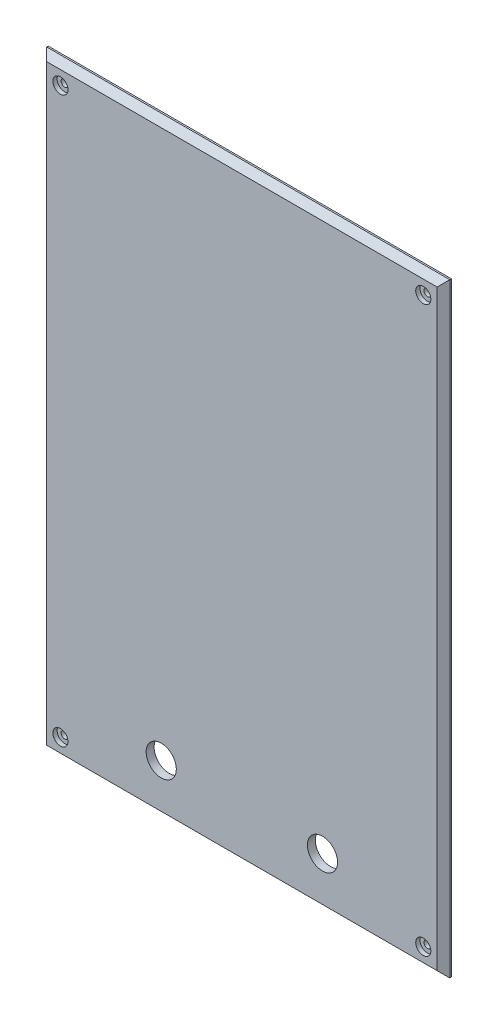
ISO-10303-21;
HEADER;
FILE_DESCRIPTION(('STEP AP214'),'2;1');
FILE_NAME('part.step','',(''),(''),'','','');
FILE_SCHEMA(('AUTOMOTIVE_DESIGN { 1 0 10303 214 1 1 1 1 }'));
ENDSEC;
DATA;
#1=APPLICATION_CONTEXT('core data for automotive mechanical design processes');
#2=APPLICATION_PROTOCOL_DEFINITION('international standard','automotive_design',2000,#1);
#3=PRODUCT_CONTEXT('',#1,'mechanical');
#4=PRODUCT('Part','Part','',(#3));
#5=PRODUCT_RELATED_PRODUCT_CATEGORY('part','',(#4));
#6=PRODUCT_DEFINITION_FORMATION('','',#4);
#7=PRODUCT_DEFINITION_CONTEXT('part definition',#1,'design');
#8=PRODUCT_DEFINITION('design','',#6,#7);
#9=PRODUCT_DEFINITION_SHAPE('','',#8);
#10=(LENGTH_UNIT() NAMED_UNIT(*) SI_UNIT(.MILLI.,.METRE.));
#11=(NAMED_UNIT(*) PLANE_ANGLE_UNIT() SI_UNIT($,.RADIAN.));
#12=(NAMED_UNIT(*) SI_UNIT($,.STERADIAN.) SOLID_ANGLE_UNIT());
#13=UNCERTAINTY_MEASURE_WITH_UNIT(LENGTH_MEASURE(1.E-05),#10,'distance_accuracy_value','');
#14=(GEOMETRIC_REPRESENTATION_CONTEXT(3) GLOBAL_UNCERTAINTY_ASSIGNED_CONTEXT((#13)) GLOBAL_UNIT_ASSIGNED_CONTEXT((#10,
#11,#12)) REPRESENTATION_CONTEXT('',''));
#15=CARTESIAN_POINT('',(0.,0.,0.));
#16=DIRECTION('',(0.,0.,1.));
#17=DIRECTION('',(1.,0.,0.));
#18=AXIS2_PLACEMENT_3D('',#15,#16,#17);
#19=CARTESIAN_POINT('',(-127.,190.5,5.));
#20=DIRECTION('',(1.,0.,0.));
#21=DIRECTION('',(0.,0.,-1.));
#22=AXIS2_PLACEMENT_3D('',#19,#20,#21);
#23=PLANE('',#22);
#24=DIRECTION('',(0.,0.,-1.));
#25=VECTOR('',#24,1.);
#26=CARTESIAN_POINT('',(-127.,-190.5,5.));
#27=LINE('',#26,#25);
#28=CARTESIAN_POINT('',(-127.,-190.5,0.999999999999997));
#29=VERTEX_POINT('',#28);
#30=CARTESIAN_POINT('',(-127.,-190.5,0.));
#31=VERTEX_POINT('',#30);
#32=EDGE_CURVE('E93',#29,#31,#27,.T.);
#33=ORIENTED_EDGE('',*,*,#32,.F.);
#34=DIRECTION('',(0.,1.,0.));
#35=VECTOR('',#34,1.);
#36=CARTESIAN_POINT('',(-127.,190.5,0.999999999999997));
#37=LINE('',#36,#35);
#38=CARTESIAN_POINT('',(-127.,190.5,0.999999999999997));
#39=VERTEX_POINT('',#38);
#40=EDGE_CURVE('E156',#29,#39,#37,.T.);
#41=ORIENTED_EDGE('',*,*,#40,.T.);
#42=DIRECTION('',(0.,0.,-1.));
#43=VECTOR('',#42,1.);
#44=CARTESIAN_POINT('',(-127.,190.5,5.));
#45=LINE('',#44,#43);
#46=CARTESIAN_POINT('',(-127.,190.5,0.));
#47=VERTEX_POINT('',#46);
#48=EDGE_CURVE('E118',#39,#47,#45,.T.);
#49=ORIENTED_EDGE('',*,*,#48,.T.);
#50=DIRECTION('',(0.,-1.,0.));
#51=VECTOR('',#50,1.);
#52=CARTESIAN_POINT('',(-127.,190.5,0.));
#53=LINE('',#52,#51);
#54=EDGE_CURVE('E113',#47,#31,#53,.T.);
#55=ORIENTED_EDGE('',*,*,#54,.T.);
#56=EDGE_LOOP('',(#33,#41,#49,#55));
#57=FACE_BOUND('',#56,.T.);
#58=ADVANCED_FACE('F38',(#57),#23,.F.);
#59=CARTESIAN_POINT('',(-127.,-190.5,5.));
#60=DIRECTION('',(0.,1.,0.));
#61=DIRECTION('',(0.,0.,1.));
#62=AXIS2_PLACEMENT_3D('',#59,#60,#61);
#63=PLANE('',#62);
#64=DIRECTION('',(0.,0.,-1.));
#65=VECTOR('',#64,1.);
#66=CARTESIAN_POINT('',(127.,-190.5,5.));
#67=LINE('',#66,#65);
#68=CARTESIAN_POINT('',(127.,-190.5,0.999999999999997));
#69=VERTEX_POINT('',#68);
#70=CARTESIAN_POINT('',(127.,-190.5,0.));
#71=VERTEX_POINT('',#70);
#72=EDGE_CURVE('E106',#69,#71,#67,.T.);
#73=ORIENTED_EDGE('',*,*,#72,.F.);
#74=DIRECTION('',(-1.,0.,0.));
#75=VECTOR('',#74,1.);
#76=CARTESIAN_POINT('',(-127.,-190.5,0.999999999999997));
#77=LINE('',#76,#75);
#78=EDGE_CURVE('E99',#69,#29,#77,.T.);
#79=ORIENTED_EDGE('',*,*,#78,.T.);
#80=ORIENTED_EDGE('',*,*,#32,.T.);
#81=DIRECTION('',(1.,0.,0.));
#82=VECTOR('',#81,1.);
#83=CARTESIAN_POINT('',(-127.,-190.5,0.));
#84=LINE('',#83,#82);
#85=EDGE_CURVE('E96',#31,#71,#84,.T.);
#86=ORIENTED_EDGE('',*,*,#85,.T.);
#87=EDGE_LOOP('',(#73,#79,#80,#86));
#88=FACE_BOUND('',#87,.T.);
#89=ADVANCED_FACE('F95',(#88),#63,.F.);
#90=CARTESIAN_POINT('',(127.,190.5,5.));
#91=DIRECTION('',(-1.,0.,0.));
#92=DIRECTION('',(0.,0.,1.));
#93=AXIS2_PLACEMENT_3D('',#90,#91,#92);
#94=PLANE('',#93);
#95=DIRECTION('',(0.,0.,-1.));
#96=VECTOR('',#95,1.);
#97=CARTESIAN_POINT('',(127.,190.5,5.));
#98=LINE('',#97,#96);
#99=CARTESIAN_POINT('',(127.,190.5,0.999999999999997));
#100=VERTEX_POINT('',#99);
#101=CARTESIAN_POINT('',(127.,190.5,0.));
#102=VERTEX_POINT('',#101);
#103=EDGE_CURVE('E139',#100,#102,#98,.T.);
#104=ORIENTED_EDGE('',*,*,#103,.F.);
#105=DIRECTION('',(0.,-1.,0.));
#106=VECTOR('',#105,1.);
#107=CARTESIAN_POINT('',(127.,-190.5,0.999999999999997));
#108=LINE('',#107,#106);
#109=EDGE_CURVE('E61',#100,#69,#108,.T.);
#110=ORIENTED_EDGE('',*,*,#109,.T.);
#111=ORIENTED_EDGE('',*,*,#72,.T.);
#112=DIRECTION('',(0.,1.,0.));
#113=VECTOR('',#112,1.);
#114=CARTESIAN_POINT('',(127.,190.5,0.));
#115=LINE('',#114,#113);
#116=EDGE_CURVE('E115',#71,#102,#115,.T.);
#117=ORIENTED_EDGE('',*,*,#116,.T.);
#118=EDGE_LOOP('',(#104,#110,#111,#117));
#119=FACE_BOUND('',#118,.T.);
#120=ADVANCED_FACE('F225',(#119),#94,.F.);
#121=CARTESIAN_POINT('',(-127.,190.5,5.));
#122=DIRECTION('',(0.,-1.,0.));
#123=DIRECTION('',(0.,0.,-1.));
#124=AXIS2_PLACEMENT_3D('',#121,#122,#123);
#125=PLANE('',#124);
#126=ORIENTED_EDGE('',*,*,#48,.F.);
#127=DIRECTION('',(1.,0.,0.));
#128=VECTOR('',#127,1.);
#129=CARTESIAN_POINT('',(127.,190.5,0.999999999999997));
#130=LINE('',#129,#128);
#131=EDGE_CURVE('E54',#39,#100,#130,.T.);
#132=ORIENTED_EDGE('',*,*,#131,.T.);
#133=ORIENTED_EDGE('',*,*,#103,.T.);
#134=DIRECTION('',(-1.,0.,0.));
#135=VECTOR('',#134,1.);
#136=CARTESIAN_POINT('',(-127.,190.5,0.));
#137=LINE('',#136,#135);
#138=EDGE_CURVE('E134',#102,#47,#137,.T.);
#139=ORIENTED_EDGE('',*,*,#138,.T.);
#140=EDGE_LOOP('',(#126,#132,#133,#139));
#141=FACE_BOUND('',#140,.T.);
#142=ADVANCED_FACE('F215',(#141),#125,.F.);
#143=CARTESIAN_POINT('',(0.,0.,5.));
#144=DIRECTION('',(0.,0.,1.));
#145=DIRECTION('',(1.,0.,0.));
#146=AXIS2_PLACEMENT_3D('',#143,#144,#145);
#147=PLANE('',#146);
#148=CARTESIAN_POINT('',(-50.8,-158.75,5.));
#149=DIRECTION('',(0.,0.,1.));
#150=DIRECTION('',(1.,0.,0.));
#151=AXIS2_PLACEMENT_3D('',#148,#149,#150);
#152=CIRCLE('',#151,9.49999999999999);
#153=CARTESIAN_POINT('',(-41.3,-158.75,5.));
#154=VERTEX_POINT('',#153);
#155=EDGE_CURVE('E351',#154,#154,#152,.T.);
#156=ORIENTED_EDGE('',*,*,#155,.F.);
#157=EDGE_LOOP('',(#156));
#158=FACE_BOUND('',#157,.T.);
#159=CARTESIAN_POINT('',(50.8,-158.75,5.));
#160=DIRECTION('',(0.,0.,1.));
#161=DIRECTION('',(1.,0.,0.));
#162=AXIS2_PLACEMENT_3D('',#159,#160,#161);
#163=CIRCLE('',#162,9.49999999999999);
#164=CARTESIAN_POINT('',(60.3,-158.75,5.));
#165=VERTEX_POINT('',#164);
#166=EDGE_CURVE('E343',#165,#165,#163,.T.);
#167=ORIENTED_EDGE('',*,*,#166,.F.);
#168=EDGE_LOOP('',(#167));
#169=FACE_BOUND('',#168,.T.);
#170=CARTESIAN_POINT('',(-114.3,-177.8,5.));
#171=DIRECTION('',(0.,0.,1.));
#172=DIRECTION('',(1.,0.,0.));
#173=AXIS2_PLACEMENT_3D('',#170,#171,#172);
#174=CIRCLE('',#173,4.7625);
#175=CARTESIAN_POINT('',(-109.5375,-177.8,5.));
#176=VERTEX_POINT('',#175);
#177=EDGE_CURVE('E335',#176,#176,#174,.T.);
#178=ORIENTED_EDGE('',*,*,#177,.F.);
#179=EDGE_LOOP('',(#178));
#180=FACE_BOUND('',#179,.T.);
#181=CARTESIAN_POINT('',(-114.3,177.8,5.));
#182=DIRECTION('',(0.,0.,1.));
#183=DIRECTION('',(1.,0.,0.));
#184=AXIS2_PLACEMENT_3D('',#181,#182,#183);
#185=CIRCLE('',#184,4.7625);
#186=CARTESIAN_POINT('',(-109.5375,177.8,5.));
#187=VERTEX_POINT('',#186);
#188=EDGE_CURVE('E317',#187,#187,#185,.T.);
#189=ORIENTED_EDGE('',*,*,#188,.F.);
#190=EDGE_LOOP('',(#189));
#191=FACE_BOUND('',#190,.T.);
#192=DIRECTION('',(-1.,0.,0.));
#193=VECTOR('',#192,1.);
#194=CARTESIAN_POINT('',(-127.,186.5,5.));
#195=LINE('',#194,#193);
#196=CARTESIAN_POINT('',(123.,186.5,5.));
#197=VERTEX_POINT('',#196);
#198=CARTESIAN_POINT('',(-123.,186.5,5.));
#199=VERTEX_POINT('',#198);
#200=EDGE_CURVE('E105',#197,#199,#195,.T.);
#201=ORIENTED_EDGE('',*,*,#200,.T.);
#202=DIRECTION('',(0.,-1.,0.));
#203=VECTOR('',#202,1.);
#204=CARTESIAN_POINT('',(-123.,-190.5,5.));
#205=LINE('',#204,#203);
#206=CARTESIAN_POINT('',(-123.,-186.5,5.));
#207=VERTEX_POINT('',#206);
#208=EDGE_CURVE('E152',#199,#207,#205,.T.);
#209=ORIENTED_EDGE('',*,*,#208,.T.);
#210=DIRECTION('',(1.,0.,0.));
#211=VECTOR('',#210,1.);
#212=CARTESIAN_POINT('',(127.,-186.5,5.));
#213=LINE('',#212,#211);
#214=CARTESIAN_POINT('',(123.,-186.5,5.));
#215=VERTEX_POINT('',#214);
#216=EDGE_CURVE('E149',#207,#215,#213,.T.);
#217=ORIENTED_EDGE('',*,*,#216,.T.);
#218=DIRECTION('',(0.,1.,0.));
#219=VECTOR('',#218,1.);
#220=CARTESIAN_POINT('',(123.,190.5,5.));
#221=LINE('',#220,#219);
#222=EDGE_CURVE('E146',#215,#197,#221,.T.);
#223=ORIENTED_EDGE('',*,*,#222,.T.);
#224=EDGE_LOOP('',(#201,#209,#217,#223));
#225=FACE_BOUND('',#224,.T.);
#226=CARTESIAN_POINT('',(114.3,177.8,5.));
#227=DIRECTION('',(0.,0.,1.));
#228=DIRECTION('',(1.,0.,0.));
#229=AXIS2_PLACEMENT_3D('',#226,#227,#228);
#230=CIRCLE('',#229,4.7625);
#231=CARTESIAN_POINT('',(119.0625,177.8,5.));
#232=VERTEX_POINT('',#231);
#233=EDGE_CURVE('E165',#232,#232,#230,.T.);
#234=ORIENTED_EDGE('',*,*,#233,.F.);
#235=EDGE_LOOP('',(#234));
#236=FACE_BOUND('',#235,.T.);
#237=CARTESIAN_POINT('',(114.3,-177.8,5.));
#238=DIRECTION('',(0.,0.,1.));
#239=DIRECTION('',(1.,0.,0.));
#240=AXIS2_PLACEMENT_3D('',#237,#238,#239);
#241=CIRCLE('',#240,4.7625);
#242=CARTESIAN_POINT('',(119.0625,-177.8,5.));
#243=VERTEX_POINT('',#242);
#244=EDGE_CURVE('E190',#243,#243,#241,.T.);
#245=ORIENTED_EDGE('',*,*,#244,.F.);
#246=EDGE_LOOP('',(#245));
#247=FACE_BOUND('',#246,.T.);
#248=ADVANCED_FACE('F213',(#158,#169,#180,#191,#225,#236,#247),#147,.T.);
#249=CARTESIAN_POINT('',(0.,0.,0.));
#250=DIRECTION('',(0.,0.,1.));
#251=DIRECTION('',(1.,0.,0.));
#252=AXIS2_PLACEMENT_3D('',#249,#250,#251);
#253=PLANE('',#252);
#254=CARTESIAN_POINT('',(-50.8,-158.75,0.));
#255=DIRECTION('',(0.,0.,1.));
#256=DIRECTION('',(1.,0.,0.));
#257=AXIS2_PLACEMENT_3D('',#254,#255,#256);
#258=CIRCLE('',#257,9.5);
#259=CARTESIAN_POINT('',(-41.3,-158.75,0.));
#260=VERTEX_POINT('',#259);
#261=EDGE_CURVE('E347',#260,#260,#258,.T.);
#262=ORIENTED_EDGE('',*,*,#261,.T.);
#263=EDGE_LOOP('',(#262));
#264=FACE_BOUND('',#263,.T.);
#265=CARTESIAN_POINT('',(50.8,-158.75,0.));
#266=DIRECTION('',(0.,0.,1.));
#267=DIRECTION('',(1.,0.,0.));
#268=AXIS2_PLACEMENT_3D('',#265,#266,#267);
#269=CIRCLE('',#268,9.5);
#270=CARTESIAN_POINT('',(60.3,-158.75,0.));
#271=VERTEX_POINT('',#270);
#272=EDGE_CURVE('E339',#271,#271,#269,.T.);
#273=ORIENTED_EDGE('',*,*,#272,.T.);
#274=EDGE_LOOP('',(#273));
#275=FACE_BOUND('',#274,.T.);
#276=CARTESIAN_POINT('',(-114.3,-177.8,0.));
#277=DIRECTION('',(0.,0.,1.));
#278=DIRECTION('',(1.,0.,0.));
#279=AXIS2_PLACEMENT_3D('',#276,#277,#278);
#280=CIRCLE('',#279,2.2479);
#281=CARTESIAN_POINT('',(-112.0521,-177.8,0.));
#282=VERTEX_POINT('',#281);
#283=EDGE_CURVE('E331',#282,#282,#280,.T.);
#284=ORIENTED_EDGE('',*,*,#283,.T.);
#285=EDGE_LOOP('',(#284));
#286=FACE_BOUND('',#285,.T.);
#287=CARTESIAN_POINT('',(-114.3,177.8,0.));
#288=DIRECTION('',(0.,0.,1.));
#289=DIRECTION('',(1.,0.,0.));
#290=AXIS2_PLACEMENT_3D('',#287,#288,#289);
#291=CIRCLE('',#290,2.2479);
#292=CARTESIAN_POINT('',(-112.0521,177.8,0.));
#293=VERTEX_POINT('',#292);
#294=EDGE_CURVE('E129',#293,#293,#291,.T.);
#295=ORIENTED_EDGE('',*,*,#294,.T.);
#296=EDGE_LOOP('',(#295));
#297=FACE_BOUND('',#296,.T.);
#298=ORIENTED_EDGE('',*,*,#54,.F.);
#299=ORIENTED_EDGE('',*,*,#138,.F.);
#300=ORIENTED_EDGE('',*,*,#116,.F.);
#301=ORIENTED_EDGE('',*,*,#85,.F.);
#302=EDGE_LOOP('',(#298,#299,#300,#301));
#303=FACE_BOUND('',#302,.T.);
#304=CARTESIAN_POINT('',(114.3,177.8,0.));
#305=DIRECTION('',(0.,0.,1.));
#306=DIRECTION('',(1.,0.,0.));
#307=AXIS2_PLACEMENT_3D('',#304,#305,#306);
#308=CIRCLE('',#307,2.2479);
#309=CARTESIAN_POINT('',(116.5479,177.8,0.));
#310=VERTEX_POINT('',#309);
#311=EDGE_CURVE('E178',#310,#310,#308,.T.);
#312=ORIENTED_EDGE('',*,*,#311,.T.);
#313=EDGE_LOOP('',(#312));
#314=FACE_BOUND('',#313,.T.);
#315=CARTESIAN_POINT('',(114.3,-177.8,0.));
#316=DIRECTION('',(0.,0.,1.));
#317=DIRECTION('',(1.,0.,0.));
#318=AXIS2_PLACEMENT_3D('',#315,#316,#317);
#319=CIRCLE('',#318,2.2479);
#320=CARTESIAN_POINT('',(116.5479,-177.8,0.));
#321=VERTEX_POINT('',#320);
#322=EDGE_CURVE('E194',#321,#321,#319,.T.);
#323=ORIENTED_EDGE('',*,*,#322,.T.);
#324=EDGE_LOOP('',(#323));
#325=FACE_BOUND('',#324,.T.);
#326=ADVANCED_FACE('F110',(#264,#275,#286,#297,#303,#314,#325),#253,.F.);
#327=CARTESIAN_POINT('',(123.,0.,5.));
#328=DIRECTION('',(0.707106781186547,0.,0.707106781186547));
#329=DIRECTION('',(0.,-1.,0.));
#330=AXIS2_PLACEMENT_3D('',#327,#328,#329);
#331=PLANE('',#330);
#332=DIRECTION('',(0.577350269189626,-0.577350269189626,-0.577350269189626));
#333=VECTOR('',#332,1.);
#334=CARTESIAN_POINT('',(60.8333333333333,-124.333333333333,67.1666666666667));
#335=LINE('',#334,#333);
#336=EDGE_CURVE('E126',#69,#215,#335,.F.);
#337=ORIENTED_EDGE('',*,*,#336,.F.);
#338=ORIENTED_EDGE('',*,*,#109,.F.);
#339=DIRECTION('',(0.577350269189626,0.577350269189626,-0.577350269189626));
#340=VECTOR('',#339,1.);
#341=CARTESIAN_POINT('',(82.,145.5,46.));
#342=LINE('',#341,#340);
#343=EDGE_CURVE('E121',#197,#100,#342,.T.);
#344=ORIENTED_EDGE('',*,*,#343,.F.);
#345=ORIENTED_EDGE('',*,*,#222,.F.);
#346=EDGE_LOOP('',(#337,#338,#344,#345));
#347=FACE_BOUND('',#346,.T.);
#348=ADVANCED_FACE('F222',(#347),#331,.T.);
#349=CARTESIAN_POINT('',(0.,186.5,5.));
#350=DIRECTION('',(0.,0.707106781186547,0.707106781186547));
#351=DIRECTION('',(1.,0.,0.));
#352=AXIS2_PLACEMENT_3D('',#349,#350,#351);
#353=PLANE('',#352);
#354=ORIENTED_EDGE('',*,*,#343,.T.);
#355=ORIENTED_EDGE('',*,*,#131,.F.);
#356=DIRECTION('',(0.577350269189626,-0.577350269189626,0.577350269189626));
#357=VECTOR('',#356,1.);
#358=CARTESIAN_POINT('',(-82.,145.5,46.));
#359=LINE('',#358,#357);
#360=EDGE_CURVE('E169',#199,#39,#359,.F.);
#361=ORIENTED_EDGE('',*,*,#360,.F.);
#362=ORIENTED_EDGE('',*,*,#200,.F.);
#363=EDGE_LOOP('',(#354,#355,#361,#362));
#364=FACE_BOUND('',#363,.T.);
#365=ADVANCED_FACE('F246',(#364),#353,.T.);
#366=CARTESIAN_POINT('',(0.,-186.5,5.));
#367=DIRECTION('',(0.,-0.707106781186547,0.707106781186547));
#368=DIRECTION('',(-1.,0.,0.));
#369=AXIS2_PLACEMENT_3D('',#366,#367,#368);
#370=PLANE('',#369);
#371=ORIENTED_EDGE('',*,*,#336,.T.);
#372=ORIENTED_EDGE('',*,*,#216,.F.);
#373=DIRECTION('',(-0.577350269189626,-0.577350269189626,-0.577350269189626));
#374=VECTOR('',#373,1.);
#375=CARTESIAN_POINT('',(-82.,-145.5,46.));
#376=LINE('',#375,#374);
#377=EDGE_CURVE('E166',#29,#207,#376,.F.);
#378=ORIENTED_EDGE('',*,*,#377,.F.);
#379=ORIENTED_EDGE('',*,*,#78,.F.);
#380=EDGE_LOOP('',(#371,#372,#378,#379));
#381=FACE_BOUND('',#380,.T.);
#382=ADVANCED_FACE('F242',(#381),#370,.T.);
#383=CARTESIAN_POINT('',(-123.,0.,5.));
#384=DIRECTION('',(-0.707106781186547,0.,0.707106781186547));
#385=DIRECTION('',(0.,1.,0.));
#386=AXIS2_PLACEMENT_3D('',#383,#384,#385);
#387=PLANE('',#386);
#388=ORIENTED_EDGE('',*,*,#360,.T.);
#389=ORIENTED_EDGE('',*,*,#40,.F.);
#390=ORIENTED_EDGE('',*,*,#377,.T.);
#391=ORIENTED_EDGE('',*,*,#208,.F.);
#392=EDGE_LOOP('',(#388,#389,#390,#391));
#393=FACE_BOUND('',#392,.T.);
#394=ADVANCED_FACE('F238',(#393),#387,.T.);
#395=CARTESIAN_POINT('',(-114.3,177.8,5.));
#396=DIRECTION('',(0.,0.,1.));
#397=DIRECTION('',(1.,0.,0.));
#398=AXIS2_PLACEMENT_3D('',#395,#396,#397);
#399=CYLINDRICAL_SURFACE('',#398,2.2479);
#400=ORIENTED_EDGE('',*,*,#294,.F.);
#401=EDGE_LOOP('',(#400));
#402=FACE_BOUND('',#401,.T.);
#403=CARTESIAN_POINT('',(-114.3,177.8,2.333));
#404=DIRECTION('',(0.,0.,1.));
#405=DIRECTION('',(1.,0.,0.));
#406=AXIS2_PLACEMENT_3D('',#403,#404,#405);
#407=CIRCLE('',#406,2.2479);
#408=CARTESIAN_POINT('',(-112.0521,177.8,2.333));
#409=VERTEX_POINT('',#408);
#410=EDGE_CURVE('E312',#409,#409,#407,.T.);
#411=ORIENTED_EDGE('',*,*,#410,.T.);
#412=EDGE_LOOP('',(#411));
#413=FACE_BOUND('',#412,.T.);
#414=ADVANCED_FACE('F241',(#402,#413),#399,.F.);
#415=CARTESIAN_POINT('',(-112.0521,177.8,2.333));
#416=DIRECTION('',(0.,0.,-1.));
#417=DIRECTION('',(-1.,0.,0.));
#418=AXIS2_PLACEMENT_3D('',#415,#416,#417);
#419=PLANE('',#418);
#420=ORIENTED_EDGE('',*,*,#410,.F.);
#421=EDGE_LOOP('',(#420));
#422=FACE_BOUND('',#421,.T.);
#423=CARTESIAN_POINT('',(-114.3,177.8,2.333));
#424=DIRECTION('',(0.,0.,1.));
#425=DIRECTION('',(1.,0.,0.));
#426=AXIS2_PLACEMENT_3D('',#423,#424,#425);
#427=CIRCLE('',#426,4.7625);
#428=CARTESIAN_POINT('',(-109.5375,177.8,2.333));
#429=VERTEX_POINT('',#428);
#430=EDGE_CURVE('E314',#429,#429,#427,.T.);
#431=ORIENTED_EDGE('',*,*,#430,.T.);
#432=EDGE_LOOP('',(#431));
#433=FACE_BOUND('',#432,.T.);
#434=ADVANCED_FACE('F299',(#422,#433),#419,.F.);
#435=CARTESIAN_POINT('',(-114.3,177.8,5.));
#436=DIRECTION('',(0.,0.,1.));
#437=DIRECTION('',(1.,0.,0.));
#438=AXIS2_PLACEMENT_3D('',#435,#436,#437);
#439=CYLINDRICAL_SURFACE('',#438,4.7625);
#440=ORIENTED_EDGE('',*,*,#430,.F.);
#441=EDGE_LOOP('',(#440));
#442=FACE_BOUND('',#441,.T.);
#443=ORIENTED_EDGE('',*,*,#188,.T.);
#444=EDGE_LOOP('',(#443));
#445=FACE_BOUND('',#444,.T.);
#446=ADVANCED_FACE('F295',(#442,#445),#439,.F.);
#447=CARTESIAN_POINT('',(-114.3,-177.8,5.));
#448=DIRECTION('',(0.,0.,1.));
#449=DIRECTION('',(1.,0.,0.));
#450=AXIS2_PLACEMENT_3D('',#447,#448,#449);
#451=CYLINDRICAL_SURFACE('',#450,2.2479);
#452=ORIENTED_EDGE('',*,*,#283,.F.);
#453=EDGE_LOOP('',(#452));
#454=FACE_BOUND('',#453,.T.);
#455=CARTESIAN_POINT('',(-114.3,-177.8,2.333));
#456=DIRECTION('',(0.,0.,1.));
#457=DIRECTION('',(1.,0.,0.));
#458=AXIS2_PLACEMENT_3D('',#455,#456,#457);
#459=CIRCLE('',#458,2.2479);
#460=CARTESIAN_POINT('',(-112.0521,-177.8,2.333));
#461=VERTEX_POINT('',#460);
#462=EDGE_CURVE('E323',#461,#461,#459,.T.);
#463=ORIENTED_EDGE('',*,*,#462,.T.);
#464=EDGE_LOOP('',(#463));
#465=FACE_BOUND('',#464,.T.);
#466=ADVANCED_FACE('F291',(#454,#465),#451,.F.);
#467=CARTESIAN_POINT('',(-112.0521,-177.8,2.333));
#468=DIRECTION('',(0.,0.,-1.));
#469=DIRECTION('',(-1.,0.,0.));
#470=AXIS2_PLACEMENT_3D('',#467,#468,#469);
#471=PLANE('',#470);
#472=ORIENTED_EDGE('',*,*,#462,.F.);
#473=EDGE_LOOP('',(#472));
#474=FACE_BOUND('',#473,.T.);
#475=CARTESIAN_POINT('',(-114.3,-177.8,2.333));
#476=DIRECTION('',(0.,0.,1.));
#477=DIRECTION('',(1.,0.,0.));
#478=AXIS2_PLACEMENT_3D('',#475,#476,#477);
#479=CIRCLE('',#478,4.7625);
#480=CARTESIAN_POINT('',(-109.5375,-177.8,2.333));
#481=VERTEX_POINT('',#480);
#482=EDGE_CURVE('E327',#481,#481,#479,.T.);
#483=ORIENTED_EDGE('',*,*,#482,.T.);
#484=EDGE_LOOP('',(#483));
#485=FACE_BOUND('',#484,.T.);
#486=ADVANCED_FACE('F287',(#474,#485),#471,.F.);
#487=CARTESIAN_POINT('',(-114.3,-177.8,5.));
#488=DIRECTION('',(0.,0.,1.));
#489=DIRECTION('',(1.,0.,0.));
#490=AXIS2_PLACEMENT_3D('',#487,#488,#489);
#491=CYLINDRICAL_SURFACE('',#490,4.7625);
#492=ORIENTED_EDGE('',*,*,#482,.F.);
#493=EDGE_LOOP('',(#492));
#494=FACE_BOUND('',#493,.T.);
#495=ORIENTED_EDGE('',*,*,#177,.T.);
#496=EDGE_LOOP('',(#495));
#497=FACE_BOUND('',#496,.T.);
#498=ADVANCED_FACE('F264',(#494,#497),#491,.F.);
#499=CARTESIAN_POINT('',(114.3,177.8,5.));
#500=DIRECTION('',(0.,0.,1.));
#501=DIRECTION('',(1.,0.,0.));
#502=AXIS2_PLACEMENT_3D('',#499,#500,#501);
#503=CYLINDRICAL_SURFACE('',#502,4.7625);
#504=CARTESIAN_POINT('',(114.3,177.8,2.333));
#505=DIRECTION('',(0.,0.,1.));
#506=DIRECTION('',(1.,0.,0.));
#507=AXIS2_PLACEMENT_3D('',#504,#505,#506);
#508=CIRCLE('',#507,4.7625);
#509=CARTESIAN_POINT('',(119.0625,177.8,2.333));
#510=VERTEX_POINT('',#509);
#511=EDGE_CURVE('E186',#510,#510,#508,.T.);
#512=ORIENTED_EDGE('',*,*,#511,.F.);
#513=EDGE_LOOP('',(#512));
#514=FACE_BOUND('',#513,.T.);
#515=ORIENTED_EDGE('',*,*,#233,.T.);
#516=EDGE_LOOP('',(#515));
#517=FACE_BOUND('',#516,.T.);
#518=ADVANCED_FACE('F260',(#514,#517),#503,.F.);
#519=CARTESIAN_POINT('',(116.5479,177.8,2.333));
#520=DIRECTION('',(0.,0.,-1.));
#521=DIRECTION('',(-1.,0.,0.));
#522=AXIS2_PLACEMENT_3D('',#519,#520,#521);
#523=PLANE('',#522);
#524=CARTESIAN_POINT('',(114.3,177.8,2.333));
#525=DIRECTION('',(0.,0.,1.));
#526=DIRECTION('',(1.,0.,0.));
#527=AXIS2_PLACEMENT_3D('',#524,#525,#526);
#528=CIRCLE('',#527,2.2479);
#529=CARTESIAN_POINT('',(116.5479,177.8,2.333));
#530=VERTEX_POINT('',#529);
#531=EDGE_CURVE('E182',#530,#530,#528,.T.);
#532=ORIENTED_EDGE('',*,*,#531,.F.);
#533=EDGE_LOOP('',(#532));
#534=FACE_BOUND('',#533,.T.);
#535=ORIENTED_EDGE('',*,*,#511,.T.);
#536=EDGE_LOOP('',(#535));
#537=FACE_BOUND('',#536,.T.);
#538=ADVANCED_FACE('F256',(#534,#537),#523,.F.);
#539=CARTESIAN_POINT('',(114.3,177.8,5.));
#540=DIRECTION('',(0.,0.,1.));
#541=DIRECTION('',(1.,0.,0.));
#542=AXIS2_PLACEMENT_3D('',#539,#540,#541);
#543=CYLINDRICAL_SURFACE('',#542,2.2479);
#544=ORIENTED_EDGE('',*,*,#311,.F.);
#545=EDGE_LOOP('',(#544));
#546=FACE_BOUND('',#545,.T.);
#547=ORIENTED_EDGE('',*,*,#531,.T.);
#548=EDGE_LOOP('',(#547));
#549=FACE_BOUND('',#548,.T.);
#550=ADVANCED_FACE('F210',(#546,#549),#543,.F.);
#551=CARTESIAN_POINT('',(114.3,-177.8,5.));
#552=DIRECTION('',(0.,0.,1.));
#553=DIRECTION('',(1.,0.,0.));
#554=AXIS2_PLACEMENT_3D('',#551,#552,#553);
#555=CYLINDRICAL_SURFACE('',#554,4.7625);
#556=CARTESIAN_POINT('',(114.3,-177.8,2.333));
#557=DIRECTION('',(0.,0.,1.));
#558=DIRECTION('',(1.,0.,0.));
#559=AXIS2_PLACEMENT_3D('',#556,#557,#558);
#560=CIRCLE('',#559,4.7625);
#561=CARTESIAN_POINT('',(119.0625,-177.8,2.333));
#562=VERTEX_POINT('',#561);
#563=EDGE_CURVE('E11',#562,#562,#560,.T.);
#564=ORIENTED_EDGE('',*,*,#563,.F.);
#565=EDGE_LOOP('',(#564));
#566=FACE_BOUND('',#565,.T.);
#567=ORIENTED_EDGE('',*,*,#244,.T.);
#568=EDGE_LOOP('',(#567));
#569=FACE_BOUND('',#568,.T.);
#570=ADVANCED_FACE('F40',(#566,#569),#555,.F.);
#571=CARTESIAN_POINT('',(116.5479,-177.8,2.333));
#572=DIRECTION('',(0.,0.,-1.));
#573=DIRECTION('',(-1.,0.,0.));
#574=AXIS2_PLACEMENT_3D('',#571,#572,#573);
#575=PLANE('',#574);
#576=CARTESIAN_POINT('',(114.3,-177.8,2.333));
#577=DIRECTION('',(0.,0.,1.));
#578=DIRECTION('',(1.,0.,0.));
#579=AXIS2_PLACEMENT_3D('',#576,#577,#578);
#580=CIRCLE('',#579,2.2479);
#581=CARTESIAN_POINT('',(116.5479,-177.8,2.333));
#582=VERTEX_POINT('',#581);
#583=EDGE_CURVE('E47',#582,#582,#580,.T.);
#584=ORIENTED_EDGE('',*,*,#583,.F.);
#585=EDGE_LOOP('',(#584));
#586=FACE_BOUND('',#585,.T.);
#587=ORIENTED_EDGE('',*,*,#563,.T.);
#588=EDGE_LOOP('',(#587));
#589=FACE_BOUND('',#588,.T.);
#590=ADVANCED_FACE('F203',(#586,#589),#575,.F.);
#591=CARTESIAN_POINT('',(114.3,-177.8,5.));
#592=DIRECTION('',(0.,0.,1.));
#593=DIRECTION('',(1.,0.,0.));
#594=AXIS2_PLACEMENT_3D('',#591,#592,#593);
#595=CYLINDRICAL_SURFACE('',#594,2.2479);
#596=ORIENTED_EDGE('',*,*,#322,.F.);
#597=EDGE_LOOP('',(#596));
#598=FACE_BOUND('',#597,.T.);
#599=ORIENTED_EDGE('',*,*,#583,.T.);
#600=EDGE_LOOP('',(#599));
#601=FACE_BOUND('',#600,.T.);
#602=ADVANCED_FACE('F201',(#598,#601),#595,.F.);
#603=CARTESIAN_POINT('',(50.8,-158.75,5.));
#604=DIRECTION('',(0.,0.,1.));
#605=DIRECTION('',(1.,0.,0.));
#606=AXIS2_PLACEMENT_3D('',#603,#604,#605);
#607=CYLINDRICAL_SURFACE('',#606,9.49999999999999);
#608=ORIENTED_EDGE('',*,*,#272,.F.);
#609=EDGE_LOOP('',(#608));
#610=FACE_BOUND('',#609,.T.);
#611=ORIENTED_EDGE('',*,*,#166,.T.);
#612=EDGE_LOOP('',(#611));
#613=FACE_BOUND('',#612,.T.);
#614=ADVANCED_FACE('F267',(#610,#613),#607,.F.);
#615=CARTESIAN_POINT('',(-50.8,-158.75,5.));
#616=DIRECTION('',(0.,0.,1.));
#617=DIRECTION('',(1.,0.,0.));
#618=AXIS2_PLACEMENT_3D('',#615,#616,#617);
#619=CYLINDRICAL_SURFACE('',#618,9.49999999999999);
#620=ORIENTED_EDGE('',*,*,#261,.F.);
#621=EDGE_LOOP('',(#620));
#622=FACE_BOUND('',#621,.T.);
#623=ORIENTED_EDGE('',*,*,#155,.T.);
#624=EDGE_LOOP('',(#623));
#625=FACE_BOUND('',#624,.T.);
#626=ADVANCED_FACE('F272',(#622,#625),#619,.F.);
#627=CLOSED_SHELL('',(#58,#89,#120,#142,#248,#326,#348,#365,#382,#394,#414,#434,#446,#466,#486,
#498,#518,#538,#550,#570,#590,#602,#614,#626));
#628=MANIFOLD_SOLID_BREP('B2',#627);
#629=ADVANCED_BREP_SHAPE_REPRESENTATION('',(#18,#628),#14);
#630=SHAPE_DEFINITION_REPRESENTATION(#9,#629);
ENDSEC;
END-ISO-10303-21;
